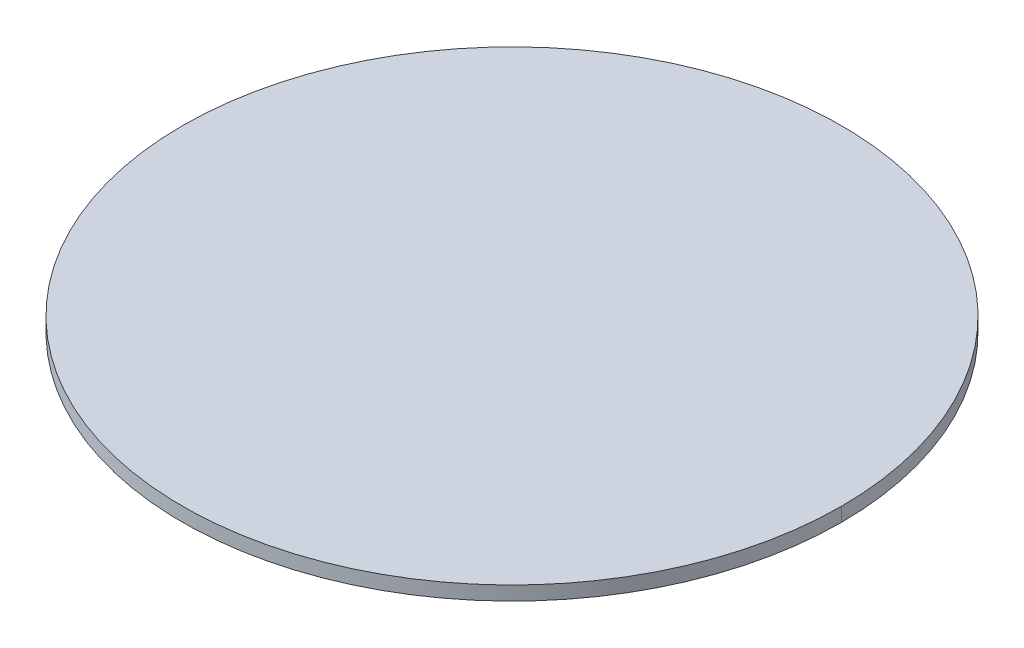
ISO-10303-21;
HEADER;
FILE_DESCRIPTION(('STEP AP214'),'2;1');
FILE_NAME('part.step','',(''),(''),'','','');
FILE_SCHEMA(('AUTOMOTIVE_DESIGN { 1 0 10303 214 1 1 1 1 }'));
ENDSEC;
DATA;
#1=APPLICATION_CONTEXT('core data for automotive mechanical design processes');
#2=APPLICATION_PROTOCOL_DEFINITION('international standard','automotive_design',2000,#1);
#3=PRODUCT_CONTEXT('',#1,'mechanical');
#4=PRODUCT('Part','Part','',(#3));
#5=PRODUCT_RELATED_PRODUCT_CATEGORY('part','',(#4));
#6=PRODUCT_DEFINITION_FORMATION('','',#4);
#7=PRODUCT_DEFINITION_CONTEXT('part definition',#1,'design');
#8=PRODUCT_DEFINITION('design','',#6,#7);
#9=PRODUCT_DEFINITION_SHAPE('','',#8);
#10=(LENGTH_UNIT() NAMED_UNIT(*) SI_UNIT(.MILLI.,.METRE.));
#11=(NAMED_UNIT(*) PLANE_ANGLE_UNIT() SI_UNIT($,.RADIAN.));
#12=(NAMED_UNIT(*) SI_UNIT($,.STERADIAN.) SOLID_ANGLE_UNIT());
#13=UNCERTAINTY_MEASURE_WITH_UNIT(LENGTH_MEASURE(1.E-05),#10,'distance_accuracy_value','');
#14=(GEOMETRIC_REPRESENTATION_CONTEXT(3) GLOBAL_UNCERTAINTY_ASSIGNED_CONTEXT((#13)) GLOBAL_UNIT_ASSIGNED_CONTEXT((#10,
#11,#12)) REPRESENTATION_CONTEXT('',''));
#15=CARTESIAN_POINT('',(0.,0.,0.));
#16=DIRECTION('',(0.,0.,1.));
#17=DIRECTION('',(1.,0.,0.));
#18=AXIS2_PLACEMENT_3D('',#15,#16,#17);
#19=CARTESIAN_POINT('',(0.,0.,0.));
#20=DIRECTION('',(0.,1.,0.));
#21=DIRECTION('',(0.,0.,1.));
#22=AXIS2_PLACEMENT_3D('',#19,#20,#21);
#23=PLANE('',#22);
#24=CARTESIAN_POINT('',(0.,0.,0.));
#25=DIRECTION('',(0.,1.,0.));
#26=DIRECTION('',(1.,0.,0.));
#27=AXIS2_PLACEMENT_3D('',#24,#25,#26);
#28=CIRCLE('',#27,2.9972);
#29=CARTESIAN_POINT('',(2.9972,0.,0.));
#30=VERTEX_POINT('',#29);
#31=CARTESIAN_POINT('',(-2.9972,0.,0.));
#32=VERTEX_POINT('',#31);
#33=EDGE_CURVE('E11',#30,#32,#28,.T.);
#34=ORIENTED_EDGE('',*,*,#33,.F.);
#35=CARTESIAN_POINT('',(0.,0.,0.));
#36=DIRECTION('',(0.,1.,0.));
#37=DIRECTION('',(1.,0.,0.));
#38=AXIS2_PLACEMENT_3D('',#35,#36,#37);
#39=CIRCLE('',#38,2.9972);
#40=EDGE_CURVE('E24',#32,#30,#39,.T.);
#41=ORIENTED_EDGE('',*,*,#40,.F.);
#42=EDGE_LOOP('',(#34,#41));
#43=FACE_BOUND('',#42,.T.);
#44=ADVANCED_FACE('F16',(#43),#23,.F.);
#45=CARTESIAN_POINT('',(0.,0.127,0.));
#46=DIRECTION('',(0.,1.,0.));
#47=DIRECTION('',(0.,0.,-1.));
#48=AXIS2_PLACEMENT_3D('',#45,#46,#47);
#49=CYLINDRICAL_SURFACE('',#48,2.9972);
#50=ORIENTED_EDGE('',*,*,#40,.T.);
#51=DIRECTION('',(0.,1.,0.));
#52=VECTOR('',#51,1.);
#53=CARTESIAN_POINT('',(2.9972,0.,0.));
#54=LINE('',#53,#52);
#55=CARTESIAN_POINT('',(2.9972,0.127,0.));
#56=VERTEX_POINT('',#55);
#57=EDGE_CURVE('E44',#30,#56,#54,.T.);
#58=ORIENTED_EDGE('',*,*,#57,.T.);
#59=CARTESIAN_POINT('',(0.,0.127,0.));
#60=DIRECTION('',(0.,1.,0.));
#61=DIRECTION('',(1.,0.,0.));
#62=AXIS2_PLACEMENT_3D('',#59,#60,#61);
#63=CIRCLE('',#62,2.9972);
#64=CARTESIAN_POINT('',(-2.9972,0.127,0.));
#65=VERTEX_POINT('',#64);
#66=EDGE_CURVE('E39',#65,#56,#63,.T.);
#67=ORIENTED_EDGE('',*,*,#66,.F.);
#68=DIRECTION('',(0.,1.,0.));
#69=VECTOR('',#68,1.);
#70=CARTESIAN_POINT('',(-2.9972,0.,0.));
#71=LINE('',#70,#69);
#72=EDGE_CURVE('E42',#32,#65,#71,.T.);
#73=ORIENTED_EDGE('',*,*,#72,.F.);
#74=EDGE_LOOP('',(#50,#58,#67,#73));
#75=FACE_BOUND('',#74,.T.);
#76=ADVANCED_FACE('F41',(#75),#49,.T.);
#77=CARTESIAN_POINT('',(0.,0.127,0.));
#78=DIRECTION('',(0.,1.,0.));
#79=DIRECTION('',(0.,0.,1.));
#80=AXIS2_PLACEMENT_3D('',#77,#78,#79);
#81=CYLINDRICAL_SURFACE('',#80,2.9972);
#82=CARTESIAN_POINT('',(0.,0.127,0.));
#83=DIRECTION('',(0.,1.,0.));
#84=DIRECTION('',(1.,0.,0.));
#85=AXIS2_PLACEMENT_3D('',#82,#83,#84);
#86=CIRCLE('',#85,2.9972);
#87=EDGE_CURVE('E51',#56,#65,#86,.T.);
#88=ORIENTED_EDGE('',*,*,#87,.F.);
#89=ORIENTED_EDGE('',*,*,#57,.F.);
#90=ORIENTED_EDGE('',*,*,#33,.T.);
#91=ORIENTED_EDGE('',*,*,#72,.T.);
#92=EDGE_LOOP('',(#88,#89,#90,#91));
#93=FACE_BOUND('',#92,.T.);
#94=ADVANCED_FACE('F50',(#93),#81,.T.);
#95=CARTESIAN_POINT('',(0.,0.127,0.));
#96=DIRECTION('',(0.,1.,0.));
#97=DIRECTION('',(0.,0.,1.));
#98=AXIS2_PLACEMENT_3D('',#95,#96,#97);
#99=PLANE('',#98);
#100=ORIENTED_EDGE('',*,*,#87,.T.);
#101=ORIENTED_EDGE('',*,*,#66,.T.);
#102=EDGE_LOOP('',(#100,#101));
#103=FACE_BOUND('',#102,.T.);
#104=ADVANCED_FACE('F53',(#103),#99,.T.);
#105=CLOSED_SHELL('',(#44,#76,#94,#104));
#106=MANIFOLD_SOLID_BREP('B1',#105);
#107=ADVANCED_BREP_SHAPE_REPRESENTATION('',(#18,#106),#14);
#108=SHAPE_DEFINITION_REPRESENTATION(#9,#107);
ENDSEC;
END-ISO-10303-21;
